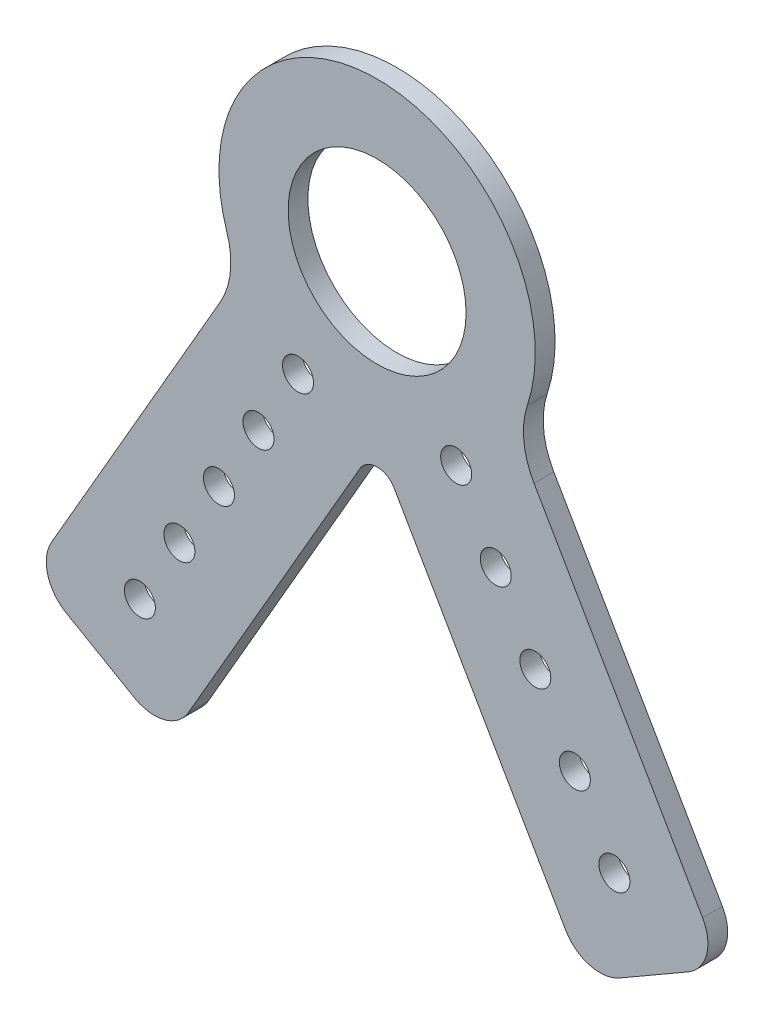
ISO-10303-21;
HEADER;
FILE_DESCRIPTION(('STEP AP214'),'2;1');
FILE_NAME('part.step','',(''),(''),'','','');
FILE_SCHEMA(('AUTOMOTIVE_DESIGN { 1 0 10303 214 1 1 1 1 }'));
ENDSEC;
DATA;
#1=APPLICATION_CONTEXT('core data for automotive mechanical design processes');
#2=APPLICATION_PROTOCOL_DEFINITION('international standard','automotive_design',2000,#1);
#3=PRODUCT_CONTEXT('',#1,'mechanical');
#4=PRODUCT('Part','Part','',(#3));
#5=PRODUCT_RELATED_PRODUCT_CATEGORY('part','',(#4));
#6=PRODUCT_DEFINITION_FORMATION('','',#4);
#7=PRODUCT_DEFINITION_CONTEXT('part definition',#1,'design');
#8=PRODUCT_DEFINITION('design','',#6,#7);
#9=PRODUCT_DEFINITION_SHAPE('','',#8);
#10=(LENGTH_UNIT() NAMED_UNIT(*) SI_UNIT(.MILLI.,.METRE.));
#11=(NAMED_UNIT(*) PLANE_ANGLE_UNIT() SI_UNIT($,.RADIAN.));
#12=(NAMED_UNIT(*) SI_UNIT($,.STERADIAN.) SOLID_ANGLE_UNIT());
#13=UNCERTAINTY_MEASURE_WITH_UNIT(LENGTH_MEASURE(1.E-05),#10,'distance_accuracy_value','');
#14=(GEOMETRIC_REPRESENTATION_CONTEXT(3) GLOBAL_UNCERTAINTY_ASSIGNED_CONTEXT((#13)) GLOBAL_UNIT_ASSIGNED_CONTEXT((#10,
#11,#12)) REPRESENTATION_CONTEXT('',''));
#15=CARTESIAN_POINT('',(0.,0.,0.));
#16=DIRECTION('',(0.,0.,1.));
#17=DIRECTION('',(1.,0.,0.));
#18=AXIS2_PLACEMENT_3D('',#15,#16,#17);
#19=CARTESIAN_POINT('',(0.,-39.9882694451998,0.));
#20=DIRECTION('',(0.,0.,1.));
#21=DIRECTION('',(1.,0.,0.));
#22=AXIS2_PLACEMENT_3D('',#19,#20,#21);
#23=PLANE('',#22);
#24=CARTESIAN_POINT('',(0.,0.,0.));
#25=DIRECTION('',(0.,0.,1.));
#26=DIRECTION('',(1.,0.,0.));
#27=AXIS2_PLACEMENT_3D('',#24,#25,#26);
#28=CIRCLE('',#27,14.2875);
#29=CARTESIAN_POINT('',(14.2875,0.,0.));
#30=VERTEX_POINT('',#29);
#31=EDGE_CURVE('E217',#30,#30,#28,.T.);
#32=ORIENTED_EDGE('',*,*,#31,.T.);
#33=EDGE_LOOP('',(#32));
#34=FACE_BOUND('',#33,.T.);
#35=CARTESIAN_POINT('',(38.1,-65.9911357683743,0.));
#36=DIRECTION('',(0.,0.,1.));
#37=DIRECTION('',(1.,0.,0.));
#38=AXIS2_PLACEMENT_3D('',#35,#36,#37);
#39=CIRCLE('',#38,2.4892);
#40=CARTESIAN_POINT('',(40.5892,-65.9911357683743,0.));
#41=VERTEX_POINT('',#40);
#42=EDGE_CURVE('E220',#41,#41,#39,.T.);
#43=ORIENTED_EDGE('',*,*,#42,.T.);
#44=EDGE_LOOP('',(#43));
#45=FACE_BOUND('',#44,.T.);
#46=CARTESIAN_POINT('',(25.4,-43.9940905122496,0.));
#47=DIRECTION('',(0.,0.,1.));
#48=DIRECTION('',(1.,0.,0.));
#49=AXIS2_PLACEMENT_3D('',#46,#47,#48);
#50=CIRCLE('',#49,2.4892);
#51=CARTESIAN_POINT('',(27.8892,-43.9940905122496,0.));
#52=VERTEX_POINT('',#51);
#53=EDGE_CURVE('E223',#52,#52,#50,.T.);
#54=ORIENTED_EDGE('',*,*,#53,.T.);
#55=EDGE_LOOP('',(#54));
#56=FACE_BOUND('',#55,.T.);
#57=CARTESIAN_POINT('',(-38.1,-65.9911357683743,0.));
#58=DIRECTION('',(0.,0.,1.));
#59=DIRECTION('',(1.,0.,0.));
#60=AXIS2_PLACEMENT_3D('',#57,#58,#59);
#61=CIRCLE('',#60,2.4892);
#62=CARTESIAN_POINT('',(-35.6108,-65.9911357683743,0.));
#63=VERTEX_POINT('',#62);
#64=EDGE_CURVE('E226',#63,#63,#61,.T.);
#65=ORIENTED_EDGE('',*,*,#64,.T.);
#66=EDGE_LOOP('',(#65));
#67=FACE_BOUND('',#66,.T.);
#68=CARTESIAN_POINT('',(-25.4,-43.9940905122496,0.));
#69=DIRECTION('',(0.,0.,1.));
#70=DIRECTION('',(1.,0.,0.));
#71=AXIS2_PLACEMENT_3D('',#68,#69,#70);
#72=CIRCLE('',#71,2.4892);
#73=CARTESIAN_POINT('',(-22.9108,-43.9940905122496,0.));
#74=VERTEX_POINT('',#73);
#75=EDGE_CURVE('E229',#74,#74,#72,.T.);
#76=ORIENTED_EDGE('',*,*,#75,.T.);
#77=EDGE_LOOP('',(#76));
#78=FACE_BOUND('',#77,.T.);
#79=CARTESIAN_POINT('',(12.7,-21.9970452561247,0.));
#80=DIRECTION('',(0.,0.,1.));
#81=DIRECTION('',(1.,0.,0.));
#82=AXIS2_PLACEMENT_3D('',#79,#80,#81);
#83=CIRCLE('',#82,2.4892);
#84=CARTESIAN_POINT('',(15.1892,-21.9970452561247,0.));
#85=VERTEX_POINT('',#84);
#86=EDGE_CURVE('E232',#85,#85,#83,.T.);
#87=ORIENTED_EDGE('',*,*,#86,.T.);
#88=EDGE_LOOP('',(#87));
#89=FACE_BOUND('',#88,.T.);
#90=CARTESIAN_POINT('',(-12.7,-21.9970452561247,0.));
#91=DIRECTION('',(0.,0.,1.));
#92=DIRECTION('',(1.,0.,0.));
#93=AXIS2_PLACEMENT_3D('',#90,#91,#92);
#94=CIRCLE('',#93,2.4892);
#95=CARTESIAN_POINT('',(-10.2108,-21.9970452561247,0.));
#96=VERTEX_POINT('',#95);
#97=EDGE_CURVE('E235',#96,#96,#94,.T.);
#98=ORIENTED_EDGE('',*,*,#97,.T.);
#99=EDGE_LOOP('',(#98));
#100=FACE_BOUND('',#99,.T.);
#101=CARTESIAN_POINT('',(-19.05,-32.9955678841872,0.));
#102=DIRECTION('',(0.,0.,1.));
#103=DIRECTION('',(1.,0.,0.));
#104=AXIS2_PLACEMENT_3D('',#101,#102,#103);
#105=CIRCLE('',#104,2.4892);
#106=CARTESIAN_POINT('',(-16.5608,-32.9955678841872,0.));
#107=VERTEX_POINT('',#106);
#108=EDGE_CURVE('E238',#107,#107,#105,.T.);
#109=ORIENTED_EDGE('',*,*,#108,.T.);
#110=EDGE_LOOP('',(#109));
#111=FACE_BOUND('',#110,.T.);
#112=CARTESIAN_POINT('',(-31.75,-54.9926131403119,0.));
#113=DIRECTION('',(0.,0.,1.));
#114=DIRECTION('',(1.,0.,0.));
#115=AXIS2_PLACEMENT_3D('',#112,#113,#114);
#116=CIRCLE('',#115,2.4892);
#117=CARTESIAN_POINT('',(-29.2608,-54.9926131403119,0.));
#118=VERTEX_POINT('',#117);
#119=EDGE_CURVE('E241',#118,#118,#116,.T.);
#120=ORIENTED_EDGE('',*,*,#119,.T.);
#121=EDGE_LOOP('',(#120));
#122=FACE_BOUND('',#121,.T.);
#123=CARTESIAN_POINT('',(19.05,-32.9955678841872,0.));
#124=DIRECTION('',(0.,0.,1.));
#125=DIRECTION('',(1.,0.,0.));
#126=AXIS2_PLACEMENT_3D('',#123,#124,#125);
#127=CIRCLE('',#126,2.4892);
#128=CARTESIAN_POINT('',(21.5392,-32.9955678841872,0.));
#129=VERTEX_POINT('',#128);
#130=EDGE_CURVE('E136',#129,#129,#127,.T.);
#131=ORIENTED_EDGE('',*,*,#130,.T.);
#132=EDGE_LOOP('',(#131));
#133=FACE_BOUND('',#132,.T.);
#134=CARTESIAN_POINT('',(31.75,-54.9926131403119,0.));
#135=DIRECTION('',(0.,0.,1.));
#136=DIRECTION('',(1.,0.,0.));
#137=AXIS2_PLACEMENT_3D('',#134,#135,#136);
#138=CIRCLE('',#137,2.4892);
#139=CARTESIAN_POINT('',(34.2392,-54.9926131403119,0.));
#140=VERTEX_POINT('',#139);
#141=EDGE_CURVE('E133',#140,#140,#138,.T.);
#142=ORIENTED_EDGE('',*,*,#141,.T.);
#143=EDGE_LOOP('',(#142));
#144=FACE_BOUND('',#143,.T.);
#145=DIRECTION('',(0.866025403784439,0.5,0.));
#146=VECTOR('',#145,1.);
#147=CARTESIAN_POINT('',(33.4514773719376,-83.3396583964367,0.));
#148=LINE('',#147,#146);
#149=CARTESIAN_POINT('',(38.9507386859688,-80.1646583964367,0.));
#150=VERTEX_POINT('',#149);
#151=CARTESIAN_POINT('',(49.9492613140312,-73.8146583964367,0.));
#152=VERTEX_POINT('',#151);
#153=EDGE_CURVE('E117',#150,#152,#148,.T.);
#154=ORIENTED_EDGE('',*,*,#153,.F.);
#155=CARTESIAN_POINT('',(35.7757386859688,-74.6653970824055,0.));
#156=DIRECTION('',(0.,0.,1.));
#157=DIRECTION('',(1.,0.,0.));
#158=AXIS2_PLACEMENT_3D('',#155,#156,#157);
#159=CIRCLE('',#158,6.35);
#160=CARTESIAN_POINT('',(30.2764773719376,-77.8403970824054,0.));
#161=VERTEX_POINT('',#160);
#162=EDGE_CURVE('E130',#161,#150,#159,.T.);
#163=ORIENTED_EDGE('',*,*,#162,.F.);
#164=DIRECTION('',(0.5,-0.866025403784439,0.));
#165=VECTOR('',#164,1.);
#166=CARTESIAN_POINT('',(0.,-25.4,0.));
#167=LINE('',#166,#165);
#168=CARTESIAN_POINT('',(2.74963065701559,-30.1625,0.));
#169=VERTEX_POINT('',#168);
#170=EDGE_CURVE('E142',#169,#161,#167,.T.);
#171=ORIENTED_EDGE('',*,*,#170,.F.);
#172=CARTESIAN_POINT('',(0.,-31.75,0.));
#173=DIRECTION('',(0.,0.,1.));
#174=DIRECTION('',(1.,0.,0.));
#175=AXIS2_PLACEMENT_3D('',#172,#173,#174);
#176=CIRCLE('',#175,3.175);
#177=CARTESIAN_POINT('',(-2.74963065701562,-30.1625,0.));
#178=VERTEX_POINT('',#177);
#179=EDGE_CURVE('E247',#169,#178,#176,.T.);
#180=ORIENTED_EDGE('',*,*,#179,.T.);
#181=DIRECTION('',(0.5,0.866025403784439,0.));
#182=VECTOR('',#181,1.);
#183=CARTESIAN_POINT('',(-33.4514773719376,-83.3396583964364,0.));
#184=LINE('',#183,#182);
#185=CARTESIAN_POINT('',(-30.2764773719376,-77.8403970824053,0.));
#186=VERTEX_POINT('',#185);
#187=EDGE_CURVE('E146',#186,#178,#184,.T.);
#188=ORIENTED_EDGE('',*,*,#187,.F.);
#189=CARTESIAN_POINT('',(-35.7757386859688,-74.6653970824053,0.));
#190=DIRECTION('',(0.,0.,1.));
#191=DIRECTION('',(1.,0.,0.));
#192=AXIS2_PLACEMENT_3D('',#189,#190,#191);
#193=CIRCLE('',#192,6.35);
#194=CARTESIAN_POINT('',(-38.9507386859688,-80.1646583964365,0.));
#195=VERTEX_POINT('',#194);
#196=EDGE_CURVE('E250',#195,#186,#193,.T.);
#197=ORIENTED_EDGE('',*,*,#196,.F.);
#198=DIRECTION('',(0.866025403784439,-0.5,0.));
#199=VECTOR('',#198,1.);
#200=CARTESIAN_POINT('',(-55.4485226280624,-70.6396583964365,0.));
#201=LINE('',#200,#199);
#202=CARTESIAN_POINT('',(-49.9492613140312,-73.8146583964365,0.));
#203=VERTEX_POINT('',#202);
#204=EDGE_CURVE('E150',#203,#195,#201,.T.);
#205=ORIENTED_EDGE('',*,*,#204,.F.);
#206=CARTESIAN_POINT('',(-46.7742613140312,-68.3153970824053,0.));
#207=DIRECTION('',(0.,0.,1.));
#208=DIRECTION('',(1.,0.,0.));
#209=AXIS2_PLACEMENT_3D('',#206,#207,#208);
#210=CIRCLE('',#209,6.35);
#211=CARTESIAN_POINT('',(-52.2735226280623,-65.1403970824053,0.));
#212=VERTEX_POINT('',#211);
#213=EDGE_CURVE('E252',#212,#203,#210,.T.);
#214=ORIENTED_EDGE('',*,*,#213,.F.);
#215=DIRECTION('',(-0.5,-0.866025403784439,0.));
#216=VECTOR('',#215,1.);
#217=CARTESIAN_POINT('',(-21.9970452561247,-12.7,0.));
#218=LINE('',#217,#216);
#219=CARTESIAN_POINT('',(-25.197554285186,-18.2434442484171,0.));
#220=VERTEX_POINT('',#219);
#221=EDGE_CURVE('E154',#220,#212,#218,.T.);
#222=ORIENTED_EDGE('',*,*,#221,.F.);
#223=CARTESIAN_POINT('',(-36.1960769132485,-11.8934442484171,0.));
#224=DIRECTION('',(0.,0.,1.));
#225=DIRECTION('',(1.,0.,0.));
#226=AXIS2_PLACEMENT_3D('',#223,#224,#225);
#227=CIRCLE('',#226,12.7);
#228=CARTESIAN_POINT('',(-24.1307179421657,-7.92896283227806,0.));
#229=VERTEX_POINT('',#228);
#230=EDGE_CURVE('E254',#220,#229,#227,.T.);
#231=ORIENTED_EDGE('',*,*,#230,.T.);
#232=CARTESIAN_POINT('',(0.,0.,0.));
#233=DIRECTION('',(0.,0.,1.));
#234=DIRECTION('',(1.,0.,0.));
#235=AXIS2_PLACEMENT_3D('',#232,#233,#234);
#236=CIRCLE('',#235,25.4);
#237=CARTESIAN_POINT('',(24.1307179421657,-7.92896283227806,0.));
#238=VERTEX_POINT('',#237);
#239=EDGE_CURVE('E258',#238,#229,#236,.T.);
#240=ORIENTED_EDGE('',*,*,#239,.F.);
#241=CARTESIAN_POINT('',(36.1960769132485,-11.8934442484171,0.));
#242=DIRECTION('',(0.,0.,1.));
#243=DIRECTION('',(1.,0.,0.));
#244=AXIS2_PLACEMENT_3D('',#241,#242,#243);
#245=CIRCLE('',#244,12.7);
#246=CARTESIAN_POINT('',(25.1975542851861,-18.2434442484171,0.));
#247=VERTEX_POINT('',#246);
#248=EDGE_CURVE('E260',#238,#247,#245,.T.);
#249=ORIENTED_EDGE('',*,*,#248,.T.);
#250=DIRECTION('',(-0.5,0.866025403784439,0.));
#251=VECTOR('',#250,1.);
#252=CARTESIAN_POINT('',(55.4485226280624,-70.6396583964367,0.));
#253=LINE('',#252,#251);
#254=CARTESIAN_POINT('',(52.2735226280624,-65.1403970824055,0.));
#255=VERTEX_POINT('',#254);
#256=EDGE_CURVE('E119',#255,#247,#253,.T.);
#257=ORIENTED_EDGE('',*,*,#256,.F.);
#258=CARTESIAN_POINT('',(46.7742613140312,-68.3153970824055,0.));
#259=DIRECTION('',(0.,0.,1.));
#260=DIRECTION('',(1.,0.,0.));
#261=AXIS2_PLACEMENT_3D('',#258,#259,#260);
#262=CIRCLE('',#261,6.35);
#263=EDGE_CURVE('E18',#152,#255,#262,.T.);
#264=ORIENTED_EDGE('',*,*,#263,.F.);
#265=EDGE_LOOP('',(#154,#163,#171,#180,#188,#197,#205,#214,#222,#231,#240,#249,#257,#264));
#266=FACE_BOUND('',#265,.T.);
#267=ADVANCED_FACE('F15',(#34,#45,#56,#67,#78,#89,#100,#111,#122,#133,#144,#266),#23,.F.);
#268=CARTESIAN_POINT('',(46.7742613140312,-68.3153970824055,0.));
#269=DIRECTION('',(0.,0.,1.));
#270=DIRECTION('',(1.,0.,0.));
#271=AXIS2_PLACEMENT_3D('',#268,#269,#270);
#272=CYLINDRICAL_SURFACE('',#271,6.35);
#273=ORIENTED_EDGE('',*,*,#263,.T.);
#274=DIRECTION('',(0.,0.,1.));
#275=VECTOR('',#274,1.);
#276=CARTESIAN_POINT('',(52.2735226280624,-65.1403970824055,0.));
#277=LINE('',#276,#275);
#278=CARTESIAN_POINT('',(52.2735226280624,-65.1403970824055,3.175));
#279=VERTEX_POINT('',#278);
#280=EDGE_CURVE('E122',#279,#255,#277,.F.);
#281=ORIENTED_EDGE('',*,*,#280,.F.);
#282=CARTESIAN_POINT('',(46.7742613140312,-68.3153970824055,3.175));
#283=DIRECTION('',(0.,0.,1.));
#284=DIRECTION('',(1.,0.,0.));
#285=AXIS2_PLACEMENT_3D('',#282,#283,#284);
#286=CIRCLE('',#285,6.35);
#287=CARTESIAN_POINT('',(49.9492613140312,-73.8146583964367,3.175));
#288=VERTEX_POINT('',#287);
#289=EDGE_CURVE('E127',#288,#279,#286,.T.);
#290=ORIENTED_EDGE('',*,*,#289,.F.);
#291=DIRECTION('',(0.,0.,1.));
#292=VECTOR('',#291,1.);
#293=CARTESIAN_POINT('',(49.9492613140312,-73.8146583964367,0.));
#294=LINE('',#293,#292);
#295=EDGE_CURVE('E124',#152,#288,#294,.T.);
#296=ORIENTED_EDGE('',*,*,#295,.F.);
#297=EDGE_LOOP('',(#273,#281,#290,#296));
#298=FACE_BOUND('',#297,.T.);
#299=ADVANCED_FACE('F125',(#298),#272,.T.);
#300=CARTESIAN_POINT('',(55.4485226280624,-70.6396583964367,0.));
#301=DIRECTION('',(0.866025403784439,0.5,0.));
#302=DIRECTION('',(-0.5,0.866025403784439,0.));
#303=AXIS2_PLACEMENT_3D('',#300,#301,#302);
#304=PLANE('',#303);
#305=DIRECTION('',(0.,0.,1.));
#306=VECTOR('',#305,1.);
#307=CARTESIAN_POINT('',(25.1975542851861,-18.243444248417,0.));
#308=LINE('',#307,#306);
#309=CARTESIAN_POINT('',(25.1975542851861,-18.2434442484171,3.175));
#310=VERTEX_POINT('',#309);
#311=EDGE_CURVE('E158',#247,#310,#308,.T.);
#312=ORIENTED_EDGE('',*,*,#311,.T.);
#313=DIRECTION('',(-0.499999999999999,0.866025403784439,0.));
#314=VECTOR('',#313,1.);
#315=CARTESIAN_POINT('',(52.2735226280624,-65.1403970824055,3.175));
#316=LINE('',#315,#314);
#317=EDGE_CURVE('E215',#279,#310,#316,.T.);
#318=ORIENTED_EDGE('',*,*,#317,.F.);
#319=ORIENTED_EDGE('',*,*,#280,.T.);
#320=ORIENTED_EDGE('',*,*,#256,.T.);
#321=EDGE_LOOP('',(#312,#318,#319,#320));
#322=FACE_BOUND('',#321,.T.);
#323=ADVANCED_FACE('F335',(#322),#304,.T.);
#324=CARTESIAN_POINT('',(36.1960769132485,-11.8934442484171,0.));
#325=DIRECTION('',(0.,0.,1.));
#326=DIRECTION('',(1.,0.,0.));
#327=AXIS2_PLACEMENT_3D('',#324,#325,#326);
#328=CYLINDRICAL_SURFACE('',#327,12.7);
#329=DIRECTION('',(0.,0.,1.));
#330=VECTOR('',#329,1.);
#331=CARTESIAN_POINT('',(24.1307179421656,-7.92896283227806,0.));
#332=LINE('',#331,#330);
#333=CARTESIAN_POINT('',(24.1307179421656,-7.92896283227805,3.175));
#334=VERTEX_POINT('',#333);
#335=EDGE_CURVE('E259',#334,#238,#332,.F.);
#336=ORIENTED_EDGE('',*,*,#335,.F.);
#337=CARTESIAN_POINT('',(36.1960769132485,-11.8934442484171,3.175));
#338=DIRECTION('',(0.,0.,1.));
#339=DIRECTION('',(1.,0.,0.));
#340=AXIS2_PLACEMENT_3D('',#337,#338,#339);
#341=CIRCLE('',#340,12.7);
#342=EDGE_CURVE('E212',#310,#334,#341,.F.);
#343=ORIENTED_EDGE('',*,*,#342,.F.);
#344=ORIENTED_EDGE('',*,*,#311,.F.);
#345=ORIENTED_EDGE('',*,*,#248,.F.);
#346=EDGE_LOOP('',(#336,#343,#344,#345));
#347=FACE_BOUND('',#346,.T.);
#348=ADVANCED_FACE('F334',(#347),#328,.F.);
#349=CARTESIAN_POINT('',(0.,0.,0.));
#350=DIRECTION('',(0.,0.,1.));
#351=DIRECTION('',(1.,0.,0.));
#352=AXIS2_PLACEMENT_3D('',#349,#350,#351);
#353=CYLINDRICAL_SURFACE('',#352,25.4);
#354=ORIENTED_EDGE('',*,*,#335,.T.);
#355=ORIENTED_EDGE('',*,*,#239,.T.);
#356=DIRECTION('',(0.,0.,1.));
#357=VECTOR('',#356,1.);
#358=CARTESIAN_POINT('',(-24.1307179421657,-7.92896283227808,0.));
#359=LINE('',#358,#357);
#360=CARTESIAN_POINT('',(-24.1307179421657,-7.92896283227808,3.175));
#361=VERTEX_POINT('',#360);
#362=EDGE_CURVE('E257',#229,#361,#359,.T.);
#363=ORIENTED_EDGE('',*,*,#362,.T.);
#364=CARTESIAN_POINT('',(0.,0.,3.175));
#365=DIRECTION('',(0.,0.,1.));
#366=DIRECTION('',(1.,0.,0.));
#367=AXIS2_PLACEMENT_3D('',#364,#365,#366);
#368=CIRCLE('',#367,25.4);
#369=EDGE_CURVE('E209',#334,#361,#368,.T.);
#370=ORIENTED_EDGE('',*,*,#369,.F.);
#371=EDGE_LOOP('',(#354,#355,#363,#370));
#372=FACE_BOUND('',#371,.T.);
#373=ADVANCED_FACE('F332',(#372),#353,.T.);
#374=CARTESIAN_POINT('',(-36.1960769132485,-11.8934442484171,0.));
#375=DIRECTION('',(0.,0.,1.));
#376=DIRECTION('',(1.,0.,0.));
#377=AXIS2_PLACEMENT_3D('',#374,#375,#376);
#378=CYLINDRICAL_SURFACE('',#377,12.7);
#379=DIRECTION('',(0.,0.,1.));
#380=VECTOR('',#379,1.);
#381=CARTESIAN_POINT('',(-25.197554285186,-18.2434442484171,0.));
#382=LINE('',#381,#380);
#383=CARTESIAN_POINT('',(-25.1975542851861,-18.2434442484171,3.175));
#384=VERTEX_POINT('',#383);
#385=EDGE_CURVE('E157',#384,#220,#382,.F.);
#386=ORIENTED_EDGE('',*,*,#385,.F.);
#387=CARTESIAN_POINT('',(-36.1960769132485,-11.8934442484171,3.175));
#388=DIRECTION('',(0.,0.,1.));
#389=DIRECTION('',(1.,0.,0.));
#390=AXIS2_PLACEMENT_3D('',#387,#388,#389);
#391=CIRCLE('',#390,12.7);
#392=EDGE_CURVE('E206',#361,#384,#391,.F.);
#393=ORIENTED_EDGE('',*,*,#392,.F.);
#394=ORIENTED_EDGE('',*,*,#362,.F.);
#395=ORIENTED_EDGE('',*,*,#230,.F.);
#396=EDGE_LOOP('',(#386,#393,#394,#395));
#397=FACE_BOUND('',#396,.T.);
#398=ADVANCED_FACE('F329',(#397),#378,.F.);
#399=CARTESIAN_POINT('',(-21.9970452561247,-12.7,0.));
#400=DIRECTION('',(-0.866025403784439,0.5,0.));
#401=DIRECTION('',(-0.5,-0.866025403784439,0.));
#402=AXIS2_PLACEMENT_3D('',#399,#400,#401);
#403=PLANE('',#402);
#404=ORIENTED_EDGE('',*,*,#385,.T.);
#405=ORIENTED_EDGE('',*,*,#221,.T.);
#406=DIRECTION('',(0.,0.,1.));
#407=VECTOR('',#406,1.);
#408=CARTESIAN_POINT('',(-52.2735226280624,-65.1403970824053,0.));
#409=LINE('',#408,#407);
#410=CARTESIAN_POINT('',(-52.2735226280624,-65.1403970824053,3.175));
#411=VERTEX_POINT('',#410);
#412=EDGE_CURVE('E156',#411,#212,#409,.F.);
#413=ORIENTED_EDGE('',*,*,#412,.F.);
#414=DIRECTION('',(-0.500000000000001,-0.866025403784438,0.));
#415=VECTOR('',#414,1.);
#416=CARTESIAN_POINT('',(-25.197554285186,-18.2434442484171,3.175));
#417=LINE('',#416,#415);
#418=EDGE_CURVE('E205',#384,#411,#417,.T.);
#419=ORIENTED_EDGE('',*,*,#418,.F.);
#420=EDGE_LOOP('',(#404,#405,#413,#419));
#421=FACE_BOUND('',#420,.T.);
#422=ADVANCED_FACE('F325',(#421),#403,.T.);
#423=CARTESIAN_POINT('',(-46.7742613140312,-68.3153970824053,0.));
#424=DIRECTION('',(0.,0.,1.));
#425=DIRECTION('',(1.,0.,0.));
#426=AXIS2_PLACEMENT_3D('',#423,#424,#425);
#427=CYLINDRICAL_SURFACE('',#426,6.35);
#428=ORIENTED_EDGE('',*,*,#213,.T.);
#429=DIRECTION('',(0.,0.,1.));
#430=VECTOR('',#429,1.);
#431=CARTESIAN_POINT('',(-49.9492613140312,-73.8146583964365,0.));
#432=LINE('',#431,#430);
#433=CARTESIAN_POINT('',(-49.9492613140312,-73.8146583964365,3.175));
#434=VERTEX_POINT('',#433);
#435=EDGE_CURVE('E153',#434,#203,#432,.F.);
#436=ORIENTED_EDGE('',*,*,#435,.F.);
#437=CARTESIAN_POINT('',(-46.7742613140312,-68.3153970824053,3.175));
#438=DIRECTION('',(0.,0.,1.));
#439=DIRECTION('',(1.,0.,0.));
#440=AXIS2_PLACEMENT_3D('',#437,#438,#439);
#441=CIRCLE('',#440,6.35);
#442=EDGE_CURVE('E202',#411,#434,#441,.T.);
#443=ORIENTED_EDGE('',*,*,#442,.F.);
#444=ORIENTED_EDGE('',*,*,#412,.T.);
#445=EDGE_LOOP('',(#428,#436,#443,#444));
#446=FACE_BOUND('',#445,.T.);
#447=ADVANCED_FACE('F322',(#446),#427,.T.);
#448=CARTESIAN_POINT('',(-55.4485226280624,-70.6396583964365,0.));
#449=DIRECTION('',(-0.5,-0.866025403784439,0.));
#450=DIRECTION('',(0.866025403784439,-0.5,0.));
#451=AXIS2_PLACEMENT_3D('',#448,#449,#450);
#452=PLANE('',#451);
#453=ORIENTED_EDGE('',*,*,#435,.T.);
#454=ORIENTED_EDGE('',*,*,#204,.T.);
#455=DIRECTION('',(0.,0.,1.));
#456=VECTOR('',#455,1.);
#457=CARTESIAN_POINT('',(-38.9507386859688,-80.1646583964365,0.));
#458=LINE('',#457,#456);
#459=CARTESIAN_POINT('',(-38.9507386859688,-80.1646583964365,3.175));
#460=VERTEX_POINT('',#459);
#461=EDGE_CURVE('E152',#460,#195,#458,.F.);
#462=ORIENTED_EDGE('',*,*,#461,.F.);
#463=DIRECTION('',(0.866025403784439,-0.499999999999999,0.));
#464=VECTOR('',#463,1.);
#465=CARTESIAN_POINT('',(-49.9492613140312,-73.8146583964365,3.175));
#466=LINE('',#465,#464);
#467=EDGE_CURVE('E201',#434,#460,#466,.T.);
#468=ORIENTED_EDGE('',*,*,#467,.F.);
#469=EDGE_LOOP('',(#453,#454,#462,#468));
#470=FACE_BOUND('',#469,.T.);
#471=ADVANCED_FACE('F319',(#470),#452,.T.);
#472=CARTESIAN_POINT('',(-35.7757386859688,-74.6653970824053,0.));
#473=DIRECTION('',(0.,0.,1.));
#474=DIRECTION('',(1.,0.,0.));
#475=AXIS2_PLACEMENT_3D('',#472,#473,#474);
#476=CYLINDRICAL_SURFACE('',#475,6.35);
#477=ORIENTED_EDGE('',*,*,#196,.T.);
#478=DIRECTION('',(0.,0.,1.));
#479=VECTOR('',#478,1.);
#480=CARTESIAN_POINT('',(-30.2764773719376,-77.8403970824053,0.));
#481=LINE('',#480,#479);
#482=CARTESIAN_POINT('',(-30.2764773719376,-77.8403970824053,3.175));
#483=VERTEX_POINT('',#482);
#484=EDGE_CURVE('E149',#483,#186,#481,.F.);
#485=ORIENTED_EDGE('',*,*,#484,.F.);
#486=CARTESIAN_POINT('',(-35.7757386859688,-74.6653970824053,3.175));
#487=DIRECTION('',(0.,0.,1.));
#488=DIRECTION('',(1.,0.,0.));
#489=AXIS2_PLACEMENT_3D('',#486,#487,#488);
#490=CIRCLE('',#489,6.35);
#491=EDGE_CURVE('E198',#460,#483,#490,.T.);
#492=ORIENTED_EDGE('',*,*,#491,.F.);
#493=ORIENTED_EDGE('',*,*,#461,.T.);
#494=EDGE_LOOP('',(#477,#485,#492,#493));
#495=FACE_BOUND('',#494,.T.);
#496=ADVANCED_FACE('F313',(#495),#476,.T.);
#497=CARTESIAN_POINT('',(-33.4514773719376,-83.3396583964364,0.));
#498=DIRECTION('',(0.866025403784439,-0.5,0.));
#499=DIRECTION('',(0.5,0.866025403784439,0.));
#500=AXIS2_PLACEMENT_3D('',#497,#498,#499);
#501=PLANE('',#500);
#502=ORIENTED_EDGE('',*,*,#484,.T.);
#503=ORIENTED_EDGE('',*,*,#187,.T.);
#504=DIRECTION('',(0.,0.,1.));
#505=VECTOR('',#504,1.);
#506=CARTESIAN_POINT('',(-2.7496306570156,-30.1625,0.));
#507=LINE('',#506,#505);
#508=CARTESIAN_POINT('',(-2.7496306570156,-30.1625,3.175));
#509=VERTEX_POINT('',#508);
#510=EDGE_CURVE('E148',#178,#509,#507,.T.);
#511=ORIENTED_EDGE('',*,*,#510,.T.);
#512=DIRECTION('',(0.500000000000001,0.866025403784438,0.));
#513=VECTOR('',#512,1.);
#514=CARTESIAN_POINT('',(-30.2764773719376,-77.8403970824053,3.175));
#515=LINE('',#514,#513);
#516=EDGE_CURVE('E197',#483,#509,#515,.T.);
#517=ORIENTED_EDGE('',*,*,#516,.F.);
#518=EDGE_LOOP('',(#502,#503,#511,#517));
#519=FACE_BOUND('',#518,.T.);
#520=ADVANCED_FACE('F310',(#519),#501,.T.);
#521=CARTESIAN_POINT('',(0.,-31.75,0.));
#522=DIRECTION('',(0.,0.,1.));
#523=DIRECTION('',(1.,0.,0.));
#524=AXIS2_PLACEMENT_3D('',#521,#522,#523);
#525=CYLINDRICAL_SURFACE('',#524,3.175);
#526=DIRECTION('',(0.,0.,1.));
#527=VECTOR('',#526,1.);
#528=CARTESIAN_POINT('',(2.74963065701559,-30.1625,0.));
#529=LINE('',#528,#527);
#530=CARTESIAN_POINT('',(2.7496306570156,-30.1625,3.175));
#531=VERTEX_POINT('',#530);
#532=EDGE_CURVE('E145',#531,#169,#529,.F.);
#533=ORIENTED_EDGE('',*,*,#532,.F.);
#534=CARTESIAN_POINT('',(0.,-31.75,3.175));
#535=DIRECTION('',(0.,0.,1.));
#536=DIRECTION('',(1.,0.,0.));
#537=AXIS2_PLACEMENT_3D('',#534,#535,#536);
#538=CIRCLE('',#537,3.175);
#539=EDGE_CURVE('E194',#509,#531,#538,.F.);
#540=ORIENTED_EDGE('',*,*,#539,.F.);
#541=ORIENTED_EDGE('',*,*,#510,.F.);
#542=ORIENTED_EDGE('',*,*,#179,.F.);
#543=EDGE_LOOP('',(#533,#540,#541,#542));
#544=FACE_BOUND('',#543,.T.);
#545=ADVANCED_FACE('F307',(#544),#525,.F.);
#546=CARTESIAN_POINT('',(0.,-25.4,0.));
#547=DIRECTION('',(-0.866025403784439,-0.5,0.));
#548=DIRECTION('',(0.5,-0.866025403784439,0.));
#549=AXIS2_PLACEMENT_3D('',#546,#547,#548);
#550=PLANE('',#549);
#551=DIRECTION('',(0.,0.,1.));
#552=VECTOR('',#551,1.);
#553=CARTESIAN_POINT('',(30.2764773719375,-77.8403970824053,0.));
#554=LINE('',#553,#552);
#555=CARTESIAN_POINT('',(30.2764773719376,-77.8403970824054,3.175));
#556=VERTEX_POINT('',#555);
#557=EDGE_CURVE('E144',#556,#161,#554,.F.);
#558=ORIENTED_EDGE('',*,*,#557,.F.);
#559=DIRECTION('',(0.500000000000001,-0.866025403784438,0.));
#560=VECTOR('',#559,1.);
#561=CARTESIAN_POINT('',(2.7496306570156,-30.1625,3.175));
#562=LINE('',#561,#560);
#563=EDGE_CURVE('E193',#531,#556,#562,.T.);
#564=ORIENTED_EDGE('',*,*,#563,.F.);
#565=ORIENTED_EDGE('',*,*,#532,.T.);
#566=ORIENTED_EDGE('',*,*,#170,.T.);
#567=EDGE_LOOP('',(#558,#564,#565,#566));
#568=FACE_BOUND('',#567,.T.);
#569=ADVANCED_FACE('F300',(#568),#550,.T.);
#570=CARTESIAN_POINT('',(35.7757386859688,-74.6653970824055,0.));
#571=DIRECTION('',(0.,0.,1.));
#572=DIRECTION('',(1.,0.,0.));
#573=AXIS2_PLACEMENT_3D('',#570,#571,#572);
#574=CYLINDRICAL_SURFACE('',#573,6.35);
#575=ORIENTED_EDGE('',*,*,#162,.T.);
#576=DIRECTION('',(0.,0.,1.));
#577=VECTOR('',#576,1.);
#578=CARTESIAN_POINT('',(38.9507386859688,-80.1646583964367,0.));
#579=LINE('',#578,#577);
#580=CARTESIAN_POINT('',(38.9507386859688,-80.1646583964367,3.175));
#581=VERTEX_POINT('',#580);
#582=EDGE_CURVE('E33',#581,#150,#579,.F.);
#583=ORIENTED_EDGE('',*,*,#582,.F.);
#584=CARTESIAN_POINT('',(35.7757386859688,-74.6653970824055,3.175));
#585=DIRECTION('',(0.,0.,1.));
#586=DIRECTION('',(1.,0.,0.));
#587=AXIS2_PLACEMENT_3D('',#584,#585,#586);
#588=CIRCLE('',#587,6.35);
#589=EDGE_CURVE('E190',#556,#581,#588,.T.);
#590=ORIENTED_EDGE('',*,*,#589,.F.);
#591=ORIENTED_EDGE('',*,*,#557,.T.);
#592=EDGE_LOOP('',(#575,#583,#590,#591));
#593=FACE_BOUND('',#592,.T.);
#594=ADVANCED_FACE('F298',(#593),#574,.T.);
#595=CARTESIAN_POINT('',(33.4514773719376,-83.3396583964367,0.));
#596=DIRECTION('',(0.5,-0.866025403784439,0.));
#597=DIRECTION('',(0.866025403784439,0.5,0.));
#598=AXIS2_PLACEMENT_3D('',#595,#596,#597);
#599=PLANE('',#598);
#600=ORIENTED_EDGE('',*,*,#582,.T.);
#601=ORIENTED_EDGE('',*,*,#153,.T.);
#602=ORIENTED_EDGE('',*,*,#295,.T.);
#603=DIRECTION('',(0.866025403784439,0.499999999999999,0.));
#604=VECTOR('',#603,1.);
#605=CARTESIAN_POINT('',(38.9507386859688,-80.1646583964367,3.175));
#606=LINE('',#605,#604);
#607=EDGE_CURVE('E189',#581,#288,#606,.T.);
#608=ORIENTED_EDGE('',*,*,#607,.F.);
#609=EDGE_LOOP('',(#600,#601,#602,#608));
#610=FACE_BOUND('',#609,.T.);
#611=ADVANCED_FACE('F132',(#610),#599,.T.);
#612=CARTESIAN_POINT('',(31.75,-54.9926131403119,155.346543507452));
#613=DIRECTION('',(0.,0.,1.));
#614=DIRECTION('',(1.,0.,0.));
#615=AXIS2_PLACEMENT_3D('',#612,#613,#614);
#616=CYLINDRICAL_SURFACE('',#615,2.4892);
#617=ORIENTED_EDGE('',*,*,#141,.F.);
#618=EDGE_LOOP('',(#617));
#619=FACE_BOUND('',#618,.T.);
#620=CARTESIAN_POINT('',(31.75,-54.9926131403119,3.17500000000001));
#621=DIRECTION('',(0.,0.,1.));
#622=DIRECTION('',(1.,0.,0.));
#623=AXIS2_PLACEMENT_3D('',#620,#621,#622);
#624=CIRCLE('',#623,2.4892);
#625=CARTESIAN_POINT('',(34.2392,-54.9926131403119,3.17500000000001));
#626=VERTEX_POINT('',#625);
#627=EDGE_CURVE('E186',#626,#626,#624,.F.);
#628=ORIENTED_EDGE('',*,*,#627,.F.);
#629=EDGE_LOOP('',(#628));
#630=FACE_BOUND('',#629,.T.);
#631=ADVANCED_FACE('F390',(#619,#630),#616,.F.);
#632=CARTESIAN_POINT('',(19.05,-32.9955678841872,155.346543507452));
#633=DIRECTION('',(0.,0.,1.));
#634=DIRECTION('',(1.,0.,0.));
#635=AXIS2_PLACEMENT_3D('',#632,#633,#634);
#636=CYLINDRICAL_SURFACE('',#635,2.4892);
#637=ORIENTED_EDGE('',*,*,#130,.F.);
#638=EDGE_LOOP('',(#637));
#639=FACE_BOUND('',#638,.T.);
#640=CARTESIAN_POINT('',(19.05,-32.9955678841872,3.17500000000001));
#641=DIRECTION('',(0.,0.,1.));
#642=DIRECTION('',(1.,0.,0.));
#643=AXIS2_PLACEMENT_3D('',#640,#641,#642);
#644=CIRCLE('',#643,2.4892);
#645=CARTESIAN_POINT('',(21.5392,-32.9955678841872,3.17500000000001));
#646=VERTEX_POINT('',#645);
#647=EDGE_CURVE('E183',#646,#646,#644,.F.);
#648=ORIENTED_EDGE('',*,*,#647,.F.);
#649=EDGE_LOOP('',(#648));
#650=FACE_BOUND('',#649,.T.);
#651=ADVANCED_FACE('F386',(#639,#650),#636,.F.);
#652=CARTESIAN_POINT('',(-31.75,-54.9926131403119,155.346543507452));
#653=DIRECTION('',(0.,0.,1.));
#654=DIRECTION('',(1.,0.,0.));
#655=AXIS2_PLACEMENT_3D('',#652,#653,#654);
#656=CYLINDRICAL_SURFACE('',#655,2.4892);
#657=ORIENTED_EDGE('',*,*,#119,.F.);
#658=EDGE_LOOP('',(#657));
#659=FACE_BOUND('',#658,.T.);
#660=CARTESIAN_POINT('',(-31.75,-54.9926131403119,3.17500000000001));
#661=DIRECTION('',(0.,0.,1.));
#662=DIRECTION('',(1.,0.,0.));
#663=AXIS2_PLACEMENT_3D('',#660,#661,#662);
#664=CIRCLE('',#663,2.4892);
#665=CARTESIAN_POINT('',(-29.2608,-54.9926131403119,3.17500000000001));
#666=VERTEX_POINT('',#665);
#667=EDGE_CURVE('E180',#666,#666,#664,.F.);
#668=ORIENTED_EDGE('',*,*,#667,.F.);
#669=EDGE_LOOP('',(#668));
#670=FACE_BOUND('',#669,.T.);
#671=ADVANCED_FACE('F382',(#659,#670),#656,.F.);
#672=CARTESIAN_POINT('',(-19.05,-32.9955678841872,155.346543507452));
#673=DIRECTION('',(0.,0.,1.));
#674=DIRECTION('',(1.,0.,0.));
#675=AXIS2_PLACEMENT_3D('',#672,#673,#674);
#676=CYLINDRICAL_SURFACE('',#675,2.4892);
#677=ORIENTED_EDGE('',*,*,#108,.F.);
#678=EDGE_LOOP('',(#677));
#679=FACE_BOUND('',#678,.T.);
#680=CARTESIAN_POINT('',(-19.05,-32.9955678841872,3.17500000000001));
#681=DIRECTION('',(0.,0.,1.));
#682=DIRECTION('',(1.,0.,0.));
#683=AXIS2_PLACEMENT_3D('',#680,#681,#682);
#684=CIRCLE('',#683,2.4892);
#685=CARTESIAN_POINT('',(-16.5608,-32.9955678841872,3.17500000000001));
#686=VERTEX_POINT('',#685);
#687=EDGE_CURVE('E177',#686,#686,#684,.F.);
#688=ORIENTED_EDGE('',*,*,#687,.F.);
#689=EDGE_LOOP('',(#688));
#690=FACE_BOUND('',#689,.T.);
#691=ADVANCED_FACE('F378',(#679,#690),#676,.F.);
#692=CARTESIAN_POINT('',(-12.7,-21.9970452561247,155.346543507452));
#693=DIRECTION('',(0.,0.,1.));
#694=DIRECTION('',(1.,0.,0.));
#695=AXIS2_PLACEMENT_3D('',#692,#693,#694);
#696=CYLINDRICAL_SURFACE('',#695,2.4892);
#697=ORIENTED_EDGE('',*,*,#97,.F.);
#698=EDGE_LOOP('',(#697));
#699=FACE_BOUND('',#698,.T.);
#700=CARTESIAN_POINT('',(-12.7,-21.9970452561247,3.17500000000001));
#701=DIRECTION('',(0.,0.,1.));
#702=DIRECTION('',(1.,0.,0.));
#703=AXIS2_PLACEMENT_3D('',#700,#701,#702);
#704=CIRCLE('',#703,2.4892);
#705=CARTESIAN_POINT('',(-10.2108,-21.9970452561247,3.17500000000001));
#706=VERTEX_POINT('',#705);
#707=EDGE_CURVE('E174',#706,#706,#704,.F.);
#708=ORIENTED_EDGE('',*,*,#707,.F.);
#709=EDGE_LOOP('',(#708));
#710=FACE_BOUND('',#709,.T.);
#711=ADVANCED_FACE('F374',(#699,#710),#696,.F.);
#712=CARTESIAN_POINT('',(12.7,-21.9970452561247,155.346543507452));
#713=DIRECTION('',(0.,0.,1.));
#714=DIRECTION('',(1.,0.,0.));
#715=AXIS2_PLACEMENT_3D('',#712,#713,#714);
#716=CYLINDRICAL_SURFACE('',#715,2.4892);
#717=ORIENTED_EDGE('',*,*,#86,.F.);
#718=EDGE_LOOP('',(#717));
#719=FACE_BOUND('',#718,.T.);
#720=CARTESIAN_POINT('',(12.7,-21.9970452561247,3.17500000000001));
#721=DIRECTION('',(0.,0.,1.));
#722=DIRECTION('',(1.,0.,0.));
#723=AXIS2_PLACEMENT_3D('',#720,#721,#722);
#724=CIRCLE('',#723,2.4892);
#725=CARTESIAN_POINT('',(15.1892,-21.9970452561247,3.17500000000001));
#726=VERTEX_POINT('',#725);
#727=EDGE_CURVE('E171',#726,#726,#724,.F.);
#728=ORIENTED_EDGE('',*,*,#727,.F.);
#729=EDGE_LOOP('',(#728));
#730=FACE_BOUND('',#729,.T.);
#731=ADVANCED_FACE('F370',(#719,#730),#716,.F.);
#732=CARTESIAN_POINT('',(-25.4,-43.9940905122496,155.346543507452));
#733=DIRECTION('',(0.,0.,1.));
#734=DIRECTION('',(1.,0.,0.));
#735=AXIS2_PLACEMENT_3D('',#732,#733,#734);
#736=CYLINDRICAL_SURFACE('',#735,2.4892);
#737=ORIENTED_EDGE('',*,*,#75,.F.);
#738=EDGE_LOOP('',(#737));
#739=FACE_BOUND('',#738,.T.);
#740=CARTESIAN_POINT('',(-25.4,-43.9940905122496,3.17500000000001));
#741=DIRECTION('',(0.,0.,1.));
#742=DIRECTION('',(1.,0.,0.));
#743=AXIS2_PLACEMENT_3D('',#740,#741,#742);
#744=CIRCLE('',#743,2.4892);
#745=CARTESIAN_POINT('',(-22.9108,-43.9940905122496,3.17500000000001));
#746=VERTEX_POINT('',#745);
#747=EDGE_CURVE('E168',#746,#746,#744,.F.);
#748=ORIENTED_EDGE('',*,*,#747,.F.);
#749=EDGE_LOOP('',(#748));
#750=FACE_BOUND('',#749,.T.);
#751=ADVANCED_FACE('F366',(#739,#750),#736,.F.);
#752=CARTESIAN_POINT('',(-38.1,-65.9911357683743,155.346543507452));
#753=DIRECTION('',(0.,0.,1.));
#754=DIRECTION('',(1.,0.,0.));
#755=AXIS2_PLACEMENT_3D('',#752,#753,#754);
#756=CYLINDRICAL_SURFACE('',#755,2.4892);
#757=ORIENTED_EDGE('',*,*,#64,.F.);
#758=EDGE_LOOP('',(#757));
#759=FACE_BOUND('',#758,.T.);
#760=CARTESIAN_POINT('',(-38.1,-65.9911357683743,3.17500000000001));
#761=DIRECTION('',(0.,0.,1.));
#762=DIRECTION('',(1.,0.,0.));
#763=AXIS2_PLACEMENT_3D('',#760,#761,#762);
#764=CIRCLE('',#763,2.4892);
#765=CARTESIAN_POINT('',(-35.6108,-65.9911357683743,3.17500000000001));
#766=VERTEX_POINT('',#765);
#767=EDGE_CURVE('E165',#766,#766,#764,.F.);
#768=ORIENTED_EDGE('',*,*,#767,.F.);
#769=EDGE_LOOP('',(#768));
#770=FACE_BOUND('',#769,.T.);
#771=ADVANCED_FACE('F362',(#759,#770),#756,.F.);
#772=CARTESIAN_POINT('',(25.4,-43.9940905122496,155.346543507452));
#773=DIRECTION('',(0.,0.,1.));
#774=DIRECTION('',(1.,0.,0.));
#775=AXIS2_PLACEMENT_3D('',#772,#773,#774);
#776=CYLINDRICAL_SURFACE('',#775,2.4892);
#777=ORIENTED_EDGE('',*,*,#53,.F.);
#778=EDGE_LOOP('',(#777));
#779=FACE_BOUND('',#778,.T.);
#780=CARTESIAN_POINT('',(25.4,-43.9940905122496,3.17500000000001));
#781=DIRECTION('',(0.,0.,1.));
#782=DIRECTION('',(1.,0.,0.));
#783=AXIS2_PLACEMENT_3D('',#780,#781,#782);
#784=CIRCLE('',#783,2.4892);
#785=CARTESIAN_POINT('',(27.8892,-43.9940905122496,3.17500000000001));
#786=VERTEX_POINT('',#785);
#787=EDGE_CURVE('E162',#786,#786,#784,.F.);
#788=ORIENTED_EDGE('',*,*,#787,.F.);
#789=EDGE_LOOP('',(#788));
#790=FACE_BOUND('',#789,.T.);
#791=ADVANCED_FACE('F358',(#779,#790),#776,.F.);
#792=CARTESIAN_POINT('',(38.1,-65.9911357683743,155.346543507452));
#793=DIRECTION('',(0.,0.,1.));
#794=DIRECTION('',(1.,0.,0.));
#795=AXIS2_PLACEMENT_3D('',#792,#793,#794);
#796=CYLINDRICAL_SURFACE('',#795,2.4892);
#797=ORIENTED_EDGE('',*,*,#42,.F.);
#798=EDGE_LOOP('',(#797));
#799=FACE_BOUND('',#798,.T.);
#800=CARTESIAN_POINT('',(38.1,-65.9911357683743,3.17500000000001));
#801=DIRECTION('',(0.,0.,1.));
#802=DIRECTION('',(1.,0.,0.));
#803=AXIS2_PLACEMENT_3D('',#800,#801,#802);
#804=CIRCLE('',#803,2.4892);
#805=CARTESIAN_POINT('',(40.5892,-65.9911357683743,3.17500000000001));
#806=VERTEX_POINT('',#805);
#807=EDGE_CURVE('E24',#806,#806,#804,.F.);
#808=ORIENTED_EDGE('',*,*,#807,.F.);
#809=EDGE_LOOP('',(#808));
#810=FACE_BOUND('',#809,.T.);
#811=ADVANCED_FACE('F351',(#799,#810),#796,.F.);
#812=CARTESIAN_POINT('',(0.,0.,0.));
#813=DIRECTION('',(0.,0.,1.));
#814=DIRECTION('',(1.,0.,0.));
#815=AXIS2_PLACEMENT_3D('',#812,#813,#814);
#816=CYLINDRICAL_SURFACE('',#815,14.2875);
#817=ORIENTED_EDGE('',*,*,#31,.F.);
#818=EDGE_LOOP('',(#817));
#819=FACE_BOUND('',#818,.T.);
#820=CARTESIAN_POINT('',(0.,0.,3.175));
#821=DIRECTION('',(0.,0.,1.));
#822=DIRECTION('',(1.,0.,0.));
#823=AXIS2_PLACEMENT_3D('',#820,#821,#822);
#824=CIRCLE('',#823,14.2875);
#825=CARTESIAN_POINT('',(14.2875,0.,3.175));
#826=VERTEX_POINT('',#825);
#827=EDGE_CURVE('E9',#826,#826,#824,.F.);
#828=ORIENTED_EDGE('',*,*,#827,.F.);
#829=EDGE_LOOP('',(#828));
#830=FACE_BOUND('',#829,.T.);
#831=ADVANCED_FACE('F345',(#819,#830),#816,.F.);
#832=CARTESIAN_POINT('',(0.,-39.9882694451998,3.175));
#833=DIRECTION('',(0.,0.,1.));
#834=DIRECTION('',(1.,0.,0.));
#835=AXIS2_PLACEMENT_3D('',#832,#833,#834);
#836=PLANE('',#835);
#837=ORIENTED_EDGE('',*,*,#827,.T.);
#838=EDGE_LOOP('',(#837));
#839=FACE_BOUND('',#838,.T.);
#840=ORIENTED_EDGE('',*,*,#807,.T.);
#841=EDGE_LOOP('',(#840));
#842=FACE_BOUND('',#841,.T.);
#843=ORIENTED_EDGE('',*,*,#787,.T.);
#844=EDGE_LOOP('',(#843));
#845=FACE_BOUND('',#844,.T.);
#846=ORIENTED_EDGE('',*,*,#767,.T.);
#847=EDGE_LOOP('',(#846));
#848=FACE_BOUND('',#847,.T.);
#849=ORIENTED_EDGE('',*,*,#747,.T.);
#850=EDGE_LOOP('',(#849));
#851=FACE_BOUND('',#850,.T.);
#852=ORIENTED_EDGE('',*,*,#727,.T.);
#853=EDGE_LOOP('',(#852));
#854=FACE_BOUND('',#853,.T.);
#855=ORIENTED_EDGE('',*,*,#707,.T.);
#856=EDGE_LOOP('',(#855));
#857=FACE_BOUND('',#856,.T.);
#858=ORIENTED_EDGE('',*,*,#687,.T.);
#859=EDGE_LOOP('',(#858));
#860=FACE_BOUND('',#859,.T.);
#861=ORIENTED_EDGE('',*,*,#667,.T.);
#862=EDGE_LOOP('',(#861));
#863=FACE_BOUND('',#862,.T.);
#864=ORIENTED_EDGE('',*,*,#647,.T.);
#865=EDGE_LOOP('',(#864));
#866=FACE_BOUND('',#865,.T.);
#867=ORIENTED_EDGE('',*,*,#627,.T.);
#868=EDGE_LOOP('',(#867));
#869=FACE_BOUND('',#868,.T.);
#870=ORIENTED_EDGE('',*,*,#589,.T.);
#871=ORIENTED_EDGE('',*,*,#607,.T.);
#872=ORIENTED_EDGE('',*,*,#289,.T.);
#873=ORIENTED_EDGE('',*,*,#317,.T.);
#874=ORIENTED_EDGE('',*,*,#342,.T.);
#875=ORIENTED_EDGE('',*,*,#369,.T.);
#876=ORIENTED_EDGE('',*,*,#392,.T.);
#877=ORIENTED_EDGE('',*,*,#418,.T.);
#878=ORIENTED_EDGE('',*,*,#442,.T.);
#879=ORIENTED_EDGE('',*,*,#467,.T.);
#880=ORIENTED_EDGE('',*,*,#491,.T.);
#881=ORIENTED_EDGE('',*,*,#516,.T.);
#882=ORIENTED_EDGE('',*,*,#539,.T.);
#883=ORIENTED_EDGE('',*,*,#563,.T.);
#884=EDGE_LOOP('',(#870,#871,#872,#873,#874,#875,#876,#877,#878,#879,#880,#881,#882,#883));
#885=FACE_BOUND('',#884,.T.);
#886=ADVANCED_FACE('F296',(#839,#842,#845,#848,#851,#854,#857,#860,#863,#866,#869,#885),#836,.T.);
#887=CLOSED_SHELL('',(#267,#299,#323,#348,#373,#398,#422,#447,#471,#496,#520,#545,#569,#594,
#611,#631,#651,#671,#691,#711,#731,#751,#771,#791,#811,#831,#886));
#888=MANIFOLD_SOLID_BREP('B1',#887);
#889=ADVANCED_BREP_SHAPE_REPRESENTATION('',(#18,#888),#14);
#890=SHAPE_DEFINITION_REPRESENTATION(#9,#889);
ENDSEC;
END-ISO-10303-21;
